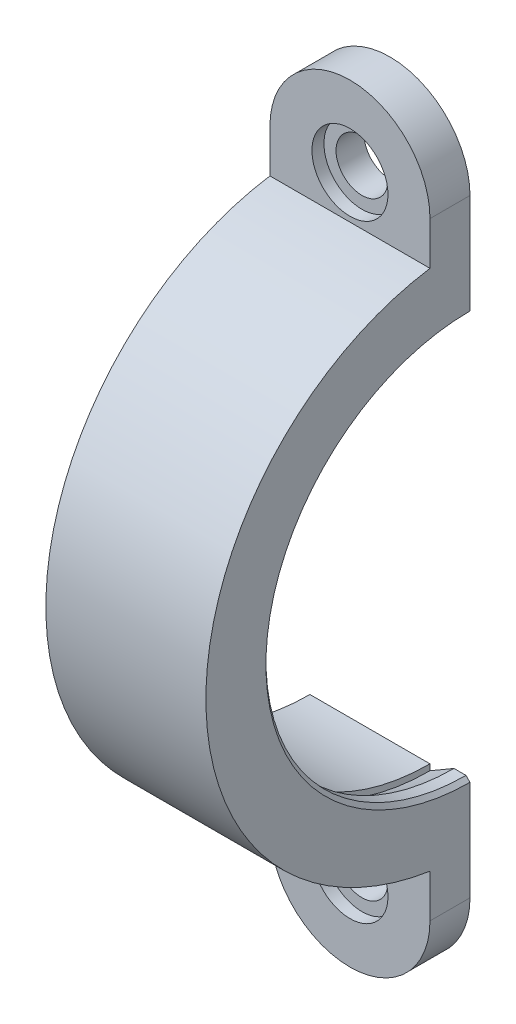
ISO-10303-21;
HEADER;
FILE_DESCRIPTION(('STEP AP214'),'2;1');
FILE_NAME('part.step','',(''),(''),'','','');
FILE_SCHEMA(('AUTOMOTIVE_DESIGN { 1 0 10303 214 1 1 1 1 }'));
ENDSEC;
DATA;
#1=APPLICATION_CONTEXT('core data for automotive mechanical design processes');
#2=APPLICATION_PROTOCOL_DEFINITION('international standard','automotive_design',2000,#1);
#3=PRODUCT_CONTEXT('',#1,'mechanical');
#4=PRODUCT('Part','Part','',(#3));
#5=PRODUCT_RELATED_PRODUCT_CATEGORY('part','',(#4));
#6=PRODUCT_DEFINITION_FORMATION('','',#4);
#7=PRODUCT_DEFINITION_CONTEXT('part definition',#1,'design');
#8=PRODUCT_DEFINITION('design','',#6,#7);
#9=PRODUCT_DEFINITION_SHAPE('','',#8);
#10=(LENGTH_UNIT() NAMED_UNIT(*) SI_UNIT(.MILLI.,.METRE.));
#11=(NAMED_UNIT(*) PLANE_ANGLE_UNIT() SI_UNIT($,.RADIAN.));
#12=(NAMED_UNIT(*) SI_UNIT($,.STERADIAN.) SOLID_ANGLE_UNIT());
#13=UNCERTAINTY_MEASURE_WITH_UNIT(LENGTH_MEASURE(1.E-05),#10,'distance_accuracy_value','');
#14=(GEOMETRIC_REPRESENTATION_CONTEXT(3) GLOBAL_UNCERTAINTY_ASSIGNED_CONTEXT((#13)) GLOBAL_UNIT_ASSIGNED_CONTEXT((#10,
#11,#12)) REPRESENTATION_CONTEXT('',''));
#15=CARTESIAN_POINT('',(0.,0.,0.));
#16=DIRECTION('',(0.,0.,1.));
#17=DIRECTION('',(1.,0.,0.));
#18=AXIS2_PLACEMENT_3D('',#15,#16,#17);
#19=CARTESIAN_POINT('',(10.,38.,33.));
#20=DIRECTION('',(0.,0.,-1.));
#21=DIRECTION('',(-1.,0.,0.));
#22=AXIS2_PLACEMENT_3D('',#19,#20,#21);
#23=CYLINDRICAL_SURFACE('',#22,3.2385);
#24=CARTESIAN_POINT('',(10.,38.,0.));
#25=DIRECTION('',(0.,0.,-1.));
#26=DIRECTION('',(-1.,0.,0.));
#27=AXIS2_PLACEMENT_3D('',#24,#25,#26);
#28=CIRCLE('',#27,3.2385);
#29=CARTESIAN_POINT('',(6.7615,38.,0.));
#30=VERTEX_POINT('',#29);
#31=EDGE_CURVE('E153',#30,#30,#28,.T.);
#32=ORIENTED_EDGE('',*,*,#31,.T.);
#33=EDGE_LOOP('',(#32));
#34=FACE_BOUND('',#33,.T.);
#35=CARTESIAN_POINT('',(10.,38.,3.5));
#36=DIRECTION('',(0.,0.,1.));
#37=DIRECTION('',(1.,0.,0.));
#38=AXIS2_PLACEMENT_3D('',#35,#36,#37);
#39=CIRCLE('',#38,3.2385);
#40=CARTESIAN_POINT('',(13.2385,38.,3.5));
#41=VERTEX_POINT('',#40);
#42=EDGE_CURVE('E224',#41,#41,#39,.F.);
#43=ORIENTED_EDGE('',*,*,#42,.F.);
#44=EDGE_LOOP('',(#43));
#45=FACE_BOUND('',#44,.T.);
#46=ADVANCED_FACE('F33',(#34,#45),#23,.F.);
#47=CARTESIAN_POINT('',(10.,-38.,33.));
#48=DIRECTION('',(0.,0.,-1.));
#49=DIRECTION('',(-1.,0.,0.));
#50=AXIS2_PLACEMENT_3D('',#47,#48,#49);
#51=CYLINDRICAL_SURFACE('',#50,3.2385);
#52=CARTESIAN_POINT('',(10.,-38.,0.));
#53=DIRECTION('',(0.,0.,-1.));
#54=DIRECTION('',(-1.,0.,0.));
#55=AXIS2_PLACEMENT_3D('',#52,#53,#54);
#56=CIRCLE('',#55,3.2385);
#57=CARTESIAN_POINT('',(6.7615,-38.,0.));
#58=VERTEX_POINT('',#57);
#59=EDGE_CURVE('E222',#58,#58,#56,.T.);
#60=ORIENTED_EDGE('',*,*,#59,.T.);
#61=EDGE_LOOP('',(#60));
#62=FACE_BOUND('',#61,.T.);
#63=CARTESIAN_POINT('',(10.,-38.,3.5));
#64=DIRECTION('',(0.,0.,1.));
#65=DIRECTION('',(1.,0.,0.));
#66=AXIS2_PLACEMENT_3D('',#63,#64,#65);
#67=CIRCLE('',#66,3.2385);
#68=CARTESIAN_POINT('',(13.2385,-38.,3.5));
#69=VERTEX_POINT('',#68);
#70=EDGE_CURVE('E219',#69,#69,#67,.F.);
#71=ORIENTED_EDGE('',*,*,#70,.F.);
#72=EDGE_LOOP('',(#71));
#73=FACE_BOUND('',#72,.T.);
#74=ADVANCED_FACE('F262',(#62,#73),#51,.F.);
#75=CARTESIAN_POINT('',(0.,0.,0.));
#76=DIRECTION('',(-1.,0.,0.));
#77=DIRECTION('',(0.,0.,1.));
#78=AXIS2_PLACEMENT_3D('',#75,#76,#77);
#79=CYLINDRICAL_SURFACE('',#78,33.);
#80=DIRECTION('',(-1.,0.,0.));
#81=VECTOR('',#80,1.);
#82=CARTESIAN_POINT('',(0.,-32.6190128606002,4.99999999999977));
#83=LINE('',#82,#81);
#84=CARTESIAN_POINT('',(20.,-32.6190128606002,4.99999999999977));
#85=VERTEX_POINT('',#84);
#86=CARTESIAN_POINT('',(0.,-32.6190128606002,4.99999999999977));
#87=VERTEX_POINT('',#86);
#88=EDGE_CURVE('E154',#85,#87,#83,.T.);
#89=ORIENTED_EDGE('',*,*,#88,.F.);
#90=CARTESIAN_POINT('',(20.,0.,0.));
#91=DIRECTION('',(-1.,0.,0.));
#92=DIRECTION('',(0.,0.,1.));
#93=AXIS2_PLACEMENT_3D('',#90,#91,#92);
#94=CIRCLE('',#93,33.);
#95=CARTESIAN_POINT('',(20.,32.6190128606002,5.));
#96=VERTEX_POINT('',#95);
#97=EDGE_CURVE('E130',#85,#96,#94,.T.);
#98=ORIENTED_EDGE('',*,*,#97,.T.);
#99=DIRECTION('',(-1.,0.,0.));
#100=VECTOR('',#99,1.);
#101=CARTESIAN_POINT('',(0.,32.6190128606002,5.));
#102=LINE('',#101,#100);
#103=CARTESIAN_POINT('',(0.,32.6190128606002,5.));
#104=VERTEX_POINT('',#103);
#105=EDGE_CURVE('E171',#96,#104,#102,.T.);
#106=ORIENTED_EDGE('',*,*,#105,.T.);
#107=CARTESIAN_POINT('',(0.,0.,0.));
#108=DIRECTION('',(-1.,0.,0.));
#109=DIRECTION('',(0.,0.,1.));
#110=AXIS2_PLACEMENT_3D('',#107,#108,#109);
#111=CIRCLE('',#110,33.);
#112=EDGE_CURVE('E211',#87,#104,#111,.T.);
#113=ORIENTED_EDGE('',*,*,#112,.F.);
#114=EDGE_LOOP('',(#89,#98,#106,#113));
#115=FACE_BOUND('',#114,.T.);
#116=ADVANCED_FACE('F247',(#115),#79,.T.);
#117=CARTESIAN_POINT('',(15.,45.946156924622,3.20840298987752E-13));
#118=DIRECTION('',(-1.,0.,0.));
#119=DIRECTION('',(0.,0.,1.));
#120=AXIS2_PLACEMENT_3D('',#117,#118,#119);
#121=PLANE('',#120);
#122=CARTESIAN_POINT('',(15.,0.,0.));
#123=DIRECTION('',(-1.,0.,0.));
#124=DIRECTION('',(0.,0.,1.));
#125=AXIS2_PLACEMENT_3D('',#122,#123,#124);
#126=CIRCLE('',#125,26.75);
#127=CARTESIAN_POINT('',(15.,-26.75,-1.86794251628108E-13));
#128=VERTEX_POINT('',#127);
#129=CARTESIAN_POINT('',(15.,26.75,0.));
#130=VERTEX_POINT('',#129);
#131=EDGE_CURVE('E216',#128,#130,#126,.T.);
#132=ORIENTED_EDGE('',*,*,#131,.F.);
#133=DIRECTION('',(0.,-1.,0.));
#134=VECTOR('',#133,1.);
#135=CARTESIAN_POINT('',(15.,45.946156924622,3.20840298987752E-13));
#136=LINE('',#135,#134);
#137=CARTESIAN_POINT('',(15.,-26.,-1.81557029619843E-13));
#138=VERTEX_POINT('',#137);
#139=EDGE_CURVE('E191',#138,#128,#136,.T.);
#140=ORIENTED_EDGE('',*,*,#139,.F.);
#141=CARTESIAN_POINT('',(15.,0.,0.));
#142=DIRECTION('',(-1.,0.,0.));
#143=DIRECTION('',(0.,0.,1.));
#144=AXIS2_PLACEMENT_3D('',#141,#142,#143);
#145=CIRCLE('',#144,26.);
#146=CARTESIAN_POINT('',(15.,26.,0.));
#147=VERTEX_POINT('',#146);
#148=EDGE_CURVE('E206',#138,#147,#145,.T.);
#149=ORIENTED_EDGE('',*,*,#148,.T.);
#150=DIRECTION('',(0.,1.,0.));
#151=VECTOR('',#150,1.);
#152=CARTESIAN_POINT('',(15.,-45.946156924622,0.));
#153=LINE('',#152,#151);
#154=EDGE_CURVE('E176',#147,#130,#153,.T.);
#155=ORIENTED_EDGE('',*,*,#154,.T.);
#156=EDGE_LOOP('',(#132,#140,#149,#155));
#157=FACE_BOUND('',#156,.T.);
#158=ADVANCED_FACE('F292',(#157),#121,.F.);
#159=CARTESIAN_POINT('',(15.,0.,0.));
#160=DIRECTION('',(-1.,0.,0.));
#161=DIRECTION('',(0.,0.,1.));
#162=AXIS2_PLACEMENT_3D('',#159,#160,#161);
#163=CONICAL_SURFACE('',#162,26.75,0.528074448426364);
#164=CARTESIAN_POINT('',(18.,0.,0.));
#165=DIRECTION('',(-1.,0.,0.));
#166=DIRECTION('',(0.,0.,1.));
#167=AXIS2_PLACEMENT_3D('',#164,#165,#166);
#168=CIRCLE('',#167,25.);
#169=CARTESIAN_POINT('',(18.,-25.,-1.74574066942157E-13));
#170=VERTEX_POINT('',#169);
#171=CARTESIAN_POINT('',(18.,25.,0.));
#172=VERTEX_POINT('',#171);
#173=EDGE_CURVE('E214',#170,#172,#168,.T.);
#174=ORIENTED_EDGE('',*,*,#173,.F.);
#175=DIRECTION('',(0.863778900898433,0.503871025524087,0.));
#176=VECTOR('',#175,1.);
#177=CARTESIAN_POINT('',(51.0635481913489,-5.71293022171306,0.));
#178=LINE('',#177,#176);
#179=EDGE_CURVE('E194',#128,#170,#178,.T.);
#180=ORIENTED_EDGE('',*,*,#179,.F.);
#181=ORIENTED_EDGE('',*,*,#131,.T.);
#182=DIRECTION('',(0.863778900898433,-0.503871025524087,0.));
#183=VECTOR('',#182,1.);
#184=CARTESIAN_POINT('',(51.0635481913489,5.71293022171306,0.));
#185=LINE('',#184,#183);
#186=EDGE_CURVE('E179',#130,#172,#185,.T.);
#187=ORIENTED_EDGE('',*,*,#186,.T.);
#188=EDGE_LOOP('',(#174,#180,#181,#187));
#189=FACE_BOUND('',#188,.T.);
#190=ADVANCED_FACE('F295',(#189),#163,.F.);
#191=CARTESIAN_POINT('',(0.,0.,0.));
#192=DIRECTION('',(-1.,0.,0.));
#193=DIRECTION('',(0.,0.,1.));
#194=AXIS2_PLACEMENT_3D('',#191,#192,#193);
#195=CYLINDRICAL_SURFACE('',#194,25.);
#196=DIRECTION('',(1.,0.,0.));
#197=VECTOR('',#196,1.);
#198=CARTESIAN_POINT('',(20.9290806893201,25.,0.));
#199=LINE('',#198,#197);
#200=CARTESIAN_POINT('',(19.5,25.,0.));
#201=VERTEX_POINT('',#200);
#202=EDGE_CURVE('E182',#172,#201,#199,.T.);
#203=ORIENTED_EDGE('',*,*,#202,.T.);
#204=CARTESIAN_POINT('',(19.5,0.,0.));
#205=DIRECTION('',(1.,0.,0.));
#206=DIRECTION('',(0.,0.,-1.));
#207=AXIS2_PLACEMENT_3D('',#204,#205,#206);
#208=CIRCLE('',#207,25.);
#209=CARTESIAN_POINT('',(19.5,-25.,-1.74574066942157E-13));
#210=VERTEX_POINT('',#209);
#211=EDGE_CURVE('E41',#201,#210,#208,.T.);
#212=ORIENTED_EDGE('',*,*,#211,.T.);
#213=DIRECTION('',(1.,0.,0.));
#214=VECTOR('',#213,1.);
#215=CARTESIAN_POINT('',(20.9290806893201,-25.,-1.74574066942157E-13));
#216=LINE('',#215,#214);
#217=EDGE_CURVE('E197',#170,#210,#216,.T.);
#218=ORIENTED_EDGE('',*,*,#217,.F.);
#219=ORIENTED_EDGE('',*,*,#173,.T.);
#220=EDGE_LOOP('',(#203,#212,#218,#219));
#221=FACE_BOUND('',#220,.T.);
#222=ADVANCED_FACE('F306',(#221),#195,.F.);
#223=CARTESIAN_POINT('',(20.,45.946156924622,3.20840298987752E-13));
#224=DIRECTION('',(1.,0.,0.));
#225=DIRECTION('',(0.,0.,-1.));
#226=AXIS2_PLACEMENT_3D('',#223,#224,#225);
#227=PLANE('',#226);
#228=DIRECTION('',(0.,1.,0.));
#229=VECTOR('',#228,1.);
#230=CARTESIAN_POINT('',(20.,45.946156924622,3.20840298987752E-13));
#231=LINE('',#230,#229);
#232=CARTESIAN_POINT('',(20.,-38.,-2.65352581752078E-13));
#233=VERTEX_POINT('',#232);
#234=CARTESIAN_POINT('',(20.,-25.5,-1.78065548281E-13));
#235=VERTEX_POINT('',#234);
#236=EDGE_CURVE('E199',#233,#235,#231,.T.);
#237=ORIENTED_EDGE('',*,*,#236,.T.);
#238=CARTESIAN_POINT('',(20.,0.,0.));
#239=DIRECTION('',(1.,0.,0.));
#240=DIRECTION('',(0.,0.,-1.));
#241=AXIS2_PLACEMENT_3D('',#238,#239,#240);
#242=CIRCLE('',#241,25.5);
#243=CARTESIAN_POINT('',(20.,25.5,0.));
#244=VERTEX_POINT('',#243);
#245=EDGE_CURVE('E218',#235,#244,#242,.F.);
#246=ORIENTED_EDGE('',*,*,#245,.T.);
#247=DIRECTION('',(0.,-1.,0.));
#248=VECTOR('',#247,1.);
#249=CARTESIAN_POINT('',(20.,-45.946156924622,0.));
#250=LINE('',#249,#248);
#251=CARTESIAN_POINT('',(20.,38.,0.));
#252=VERTEX_POINT('',#251);
#253=EDGE_CURVE('E184',#252,#244,#250,.T.);
#254=ORIENTED_EDGE('',*,*,#253,.F.);
#255=DIRECTION('',(0.,0.,-1.));
#256=VECTOR('',#255,1.);
#257=CARTESIAN_POINT('',(20.,38.,5.));
#258=LINE('',#257,#256);
#259=CARTESIAN_POINT('',(20.,38.,5.));
#260=VERTEX_POINT('',#259);
#261=EDGE_CURVE('E168',#260,#252,#258,.T.);
#262=ORIENTED_EDGE('',*,*,#261,.F.);
#263=DIRECTION('',(0.,-1.,0.));
#264=VECTOR('',#263,1.);
#265=CARTESIAN_POINT('',(20.,29.,5.));
#266=LINE('',#265,#264);
#267=EDGE_CURVE('E158',#260,#96,#266,.T.);
#268=ORIENTED_EDGE('',*,*,#267,.T.);
#269=ORIENTED_EDGE('',*,*,#97,.F.);
#270=DIRECTION('',(0.,-1.,0.));
#271=VECTOR('',#270,1.);
#272=CARTESIAN_POINT('',(20.,-29.,4.9999999999998));
#273=LINE('',#272,#271);
#274=CARTESIAN_POINT('',(20.,-38.,4.99999999999973));
#275=VERTEX_POINT('',#274);
#276=EDGE_CURVE('E123',#85,#275,#273,.T.);
#277=ORIENTED_EDGE('',*,*,#276,.T.);
#278=DIRECTION('',(0.,0.,-1.));
#279=VECTOR('',#278,1.);
#280=CARTESIAN_POINT('',(20.,-38.,4.99999999999973));
#281=LINE('',#280,#279);
#282=EDGE_CURVE('E127',#275,#233,#281,.T.);
#283=ORIENTED_EDGE('',*,*,#282,.T.);
#284=EDGE_LOOP('',(#237,#246,#254,#262,#268,#269,#277,#283));
#285=FACE_BOUND('',#284,.T.);
#286=ADVANCED_FACE('F126',(#285),#227,.T.);
#287=CARTESIAN_POINT('',(0.,45.946156924622,3.20840298987752E-13));
#288=DIRECTION('',(1.,0.,0.));
#289=DIRECTION('',(0.,0.,-1.));
#290=AXIS2_PLACEMENT_3D('',#287,#288,#289);
#291=PLANE('',#290);
#292=CARTESIAN_POINT('',(0.,0.,0.));
#293=DIRECTION('',(-1.,0.,0.));
#294=DIRECTION('',(0.,0.,1.));
#295=AXIS2_PLACEMENT_3D('',#292,#293,#294);
#296=CIRCLE('',#295,26.);
#297=CARTESIAN_POINT('',(0.,-26.,-1.81557029619843E-13));
#298=VERTEX_POINT('',#297);
#299=CARTESIAN_POINT('',(0.,26.,0.));
#300=VERTEX_POINT('',#299);
#301=EDGE_CURVE('E208',#298,#300,#296,.T.);
#302=ORIENTED_EDGE('',*,*,#301,.F.);
#303=DIRECTION('',(0.,1.,0.));
#304=VECTOR('',#303,1.);
#305=CARTESIAN_POINT('',(0.,45.946156924622,3.20840298987752E-13));
#306=LINE('',#305,#304);
#307=CARTESIAN_POINT('',(0.,-38.,-2.65352581752078E-13));
#308=VERTEX_POINT('',#307);
#309=EDGE_CURVE('E201',#308,#298,#306,.T.);
#310=ORIENTED_EDGE('',*,*,#309,.F.);
#311=DIRECTION('',(0.,0.,-1.));
#312=VECTOR('',#311,1.);
#313=CARTESIAN_POINT('',(0.,-38.,4.99999999999973));
#314=LINE('',#313,#312);
#315=CARTESIAN_POINT('',(0.,-38.,4.99999999999973));
#316=VERTEX_POINT('',#315);
#317=EDGE_CURVE('E142',#316,#308,#314,.T.);
#318=ORIENTED_EDGE('',*,*,#317,.F.);
#319=DIRECTION('',(0.,1.,0.));
#320=VECTOR('',#319,1.);
#321=CARTESIAN_POINT('',(0.,-29.,4.9999999999998));
#322=LINE('',#321,#320);
#323=EDGE_CURVE('E143',#316,#87,#322,.T.);
#324=ORIENTED_EDGE('',*,*,#323,.T.);
#325=ORIENTED_EDGE('',*,*,#112,.T.);
#326=DIRECTION('',(0.,1.,0.));
#327=VECTOR('',#326,1.);
#328=CARTESIAN_POINT('',(0.,29.,5.));
#329=LINE('',#328,#327);
#330=CARTESIAN_POINT('',(0.,38.,5.));
#331=VERTEX_POINT('',#330);
#332=EDGE_CURVE('E160',#104,#331,#329,.T.);
#333=ORIENTED_EDGE('',*,*,#332,.T.);
#334=DIRECTION('',(0.,0.,-1.));
#335=VECTOR('',#334,1.);
#336=CARTESIAN_POINT('',(0.,38.,5.));
#337=LINE('',#336,#335);
#338=CARTESIAN_POINT('',(0.,38.,0.));
#339=VERTEX_POINT('',#338);
#340=EDGE_CURVE('E165',#331,#339,#337,.T.);
#341=ORIENTED_EDGE('',*,*,#340,.T.);
#342=DIRECTION('',(0.,-1.,0.));
#343=VECTOR('',#342,1.);
#344=CARTESIAN_POINT('',(0.,-45.946156924622,0.));
#345=LINE('',#344,#343);
#346=EDGE_CURVE('E186',#339,#300,#345,.T.);
#347=ORIENTED_EDGE('',*,*,#346,.T.);
#348=EDGE_LOOP('',(#302,#310,#318,#324,#325,#333,#341,#347));
#349=FACE_BOUND('',#348,.T.);
#350=ADVANCED_FACE('F250',(#349),#291,.F.);
#351=CARTESIAN_POINT('',(0.,0.,0.));
#352=DIRECTION('',(-1.,0.,0.));
#353=DIRECTION('',(0.,0.,1.));
#354=AXIS2_PLACEMENT_3D('',#351,#352,#353);
#355=CYLINDRICAL_SURFACE('',#354,26.);
#356=DIRECTION('',(1.,0.,0.));
#357=VECTOR('',#356,1.);
#358=CARTESIAN_POINT('',(20.9290806893201,-26.,-1.81557029619843E-13));
#359=LINE('',#358,#357);
#360=EDGE_CURVE('E203',#298,#138,#359,.T.);
#361=ORIENTED_EDGE('',*,*,#360,.F.);
#362=ORIENTED_EDGE('',*,*,#301,.T.);
#363=DIRECTION('',(1.,0.,0.));
#364=VECTOR('',#363,1.);
#365=CARTESIAN_POINT('',(20.9290806893201,26.,0.));
#366=LINE('',#365,#364);
#367=EDGE_CURVE('E188',#300,#147,#366,.T.);
#368=ORIENTED_EDGE('',*,*,#367,.T.);
#369=ORIENTED_EDGE('',*,*,#148,.F.);
#370=EDGE_LOOP('',(#361,#362,#368,#369));
#371=FACE_BOUND('',#370,.T.);
#372=ADVANCED_FACE('F288',(#371),#355,.F.);
#373=CARTESIAN_POINT('',(20.9290806893201,45.946156924622,3.20840298987752E-13));
#374=DIRECTION('',(0.,0.,-1.));
#375=DIRECTION('',(1.,0.,0.));
#376=AXIS2_PLACEMENT_3D('',#373,#374,#375);
#377=PLANE('',#376);
#378=ORIENTED_EDGE('',*,*,#59,.F.);
#379=EDGE_LOOP('',(#378));
#380=FACE_BOUND('',#379,.T.);
#381=ORIENTED_EDGE('',*,*,#217,.T.);
#382=DIRECTION('',(-0.70710678118655,0.707106781186545,0.));
#383=VECTOR('',#382,1.);
#384=CARTESIAN_POINT('',(-5.50000000000016,0.,0.));
#385=LINE('',#384,#383);
#386=EDGE_CURVE('E11',#210,#235,#385,.F.);
#387=ORIENTED_EDGE('',*,*,#386,.T.);
#388=ORIENTED_EDGE('',*,*,#236,.F.);
#389=CARTESIAN_POINT('',(10.,-38.,-2.65352581752078E-13));
#390=DIRECTION('',(0.,0.,-1.));
#391=DIRECTION('',(0.,-1.,0.));
#392=AXIS2_PLACEMENT_3D('',#389,#390,#391);
#393=CIRCLE('',#392,10.);
#394=EDGE_CURVE('E135',#233,#308,#393,.T.);
#395=ORIENTED_EDGE('',*,*,#394,.T.);
#396=ORIENTED_EDGE('',*,*,#309,.T.);
#397=ORIENTED_EDGE('',*,*,#360,.T.);
#398=ORIENTED_EDGE('',*,*,#139,.T.);
#399=ORIENTED_EDGE('',*,*,#179,.T.);
#400=EDGE_LOOP('',(#381,#387,#388,#395,#396,#397,#398,#399));
#401=FACE_BOUND('',#400,.T.);
#402=ADVANCED_FACE('F252',(#380,#401),#377,.T.);
#403=CARTESIAN_POINT('',(20.9290806893201,-45.946156924622,0.));
#404=DIRECTION('',(0.,0.,1.));
#405=DIRECTION('',(1.,0.,0.));
#406=AXIS2_PLACEMENT_3D('',#403,#404,#405);
#407=PLANE('',#406);
#408=ORIENTED_EDGE('',*,*,#31,.F.);
#409=EDGE_LOOP('',(#408));
#410=FACE_BOUND('',#409,.T.);
#411=ORIENTED_EDGE('',*,*,#253,.T.);
#412=DIRECTION('',(-0.70710678118655,-0.707106781186545,0.));
#413=VECTOR('',#412,1.);
#414=CARTESIAN_POINT('',(-5.50000000000016,0.,0.));
#415=LINE('',#414,#413);
#416=EDGE_CURVE('E55',#244,#201,#415,.T.);
#417=ORIENTED_EDGE('',*,*,#416,.T.);
#418=ORIENTED_EDGE('',*,*,#202,.F.);
#419=ORIENTED_EDGE('',*,*,#186,.F.);
#420=ORIENTED_EDGE('',*,*,#154,.F.);
#421=ORIENTED_EDGE('',*,*,#367,.F.);
#422=ORIENTED_EDGE('',*,*,#346,.F.);
#423=CARTESIAN_POINT('',(10.,38.,0.));
#424=DIRECTION('',(0.,0.,-1.));
#425=DIRECTION('',(-1.,0.,0.));
#426=AXIS2_PLACEMENT_3D('',#423,#424,#425);
#427=CIRCLE('',#426,10.);
#428=EDGE_CURVE('E157',#339,#252,#427,.T.);
#429=ORIENTED_EDGE('',*,*,#428,.T.);
#430=EDGE_LOOP('',(#411,#417,#418,#419,#420,#421,#422,#429));
#431=FACE_BOUND('',#430,.T.);
#432=ADVANCED_FACE('F234',(#410,#431),#407,.F.);
#433=CARTESIAN_POINT('',(10.,38.,5.));
#434=DIRECTION('',(0.,0.,-1.));
#435=DIRECTION('',(-1.,0.,0.));
#436=AXIS2_PLACEMENT_3D('',#433,#434,#435);
#437=CYLINDRICAL_SURFACE('',#436,10.);
#438=ORIENTED_EDGE('',*,*,#428,.F.);
#439=ORIENTED_EDGE('',*,*,#340,.F.);
#440=CARTESIAN_POINT('',(10.,38.,5.));
#441=DIRECTION('',(0.,0.,-1.));
#442=DIRECTION('',(-1.,0.,0.));
#443=AXIS2_PLACEMENT_3D('',#440,#441,#442);
#444=CIRCLE('',#443,10.);
#445=EDGE_CURVE('E162',#331,#260,#444,.T.);
#446=ORIENTED_EDGE('',*,*,#445,.T.);
#447=ORIENTED_EDGE('',*,*,#261,.T.);
#448=EDGE_LOOP('',(#438,#439,#446,#447));
#449=FACE_BOUND('',#448,.T.);
#450=ADVANCED_FACE('F239',(#449),#437,.T.);
#451=CARTESIAN_POINT('',(10.,38.,5.));
#452=DIRECTION('',(0.,0.,-1.));
#453=DIRECTION('',(-1.,0.,0.));
#454=AXIS2_PLACEMENT_3D('',#451,#452,#453);
#455=PLANE('',#454);
#456=CARTESIAN_POINT('',(10.,38.,5.));
#457=DIRECTION('',(0.,0.,1.));
#458=DIRECTION('',(1.,0.,0.));
#459=AXIS2_PLACEMENT_3D('',#456,#457,#458);
#460=CIRCLE('',#459,4.75000000000001);
#461=CARTESIAN_POINT('',(14.75,38.,5.));
#462=VERTEX_POINT('',#461);
#463=EDGE_CURVE('E462',#462,#462,#460,.T.);
#464=ORIENTED_EDGE('',*,*,#463,.F.);
#465=EDGE_LOOP('',(#464));
#466=FACE_BOUND('',#465,.T.);
#467=ORIENTED_EDGE('',*,*,#105,.F.);
#468=ORIENTED_EDGE('',*,*,#267,.F.);
#469=ORIENTED_EDGE('',*,*,#445,.F.);
#470=ORIENTED_EDGE('',*,*,#332,.F.);
#471=EDGE_LOOP('',(#467,#468,#469,#470));
#472=FACE_BOUND('',#471,.T.);
#473=ADVANCED_FACE('F244',(#466,#472),#455,.F.);
#474=CARTESIAN_POINT('',(10.,-38.,4.99999999999973));
#475=DIRECTION('',(0.,0.,-1.));
#476=DIRECTION('',(0.,1.,0.));
#477=AXIS2_PLACEMENT_3D('',#474,#475,#476);
#478=CYLINDRICAL_SURFACE('',#477,10.);
#479=ORIENTED_EDGE('',*,*,#394,.F.);
#480=ORIENTED_EDGE('',*,*,#282,.F.);
#481=CARTESIAN_POINT('',(10.,-38.,4.99999999999973));
#482=DIRECTION('',(0.,0.,-1.));
#483=DIRECTION('',(0.,-1.,0.));
#484=AXIS2_PLACEMENT_3D('',#481,#482,#483);
#485=CIRCLE('',#484,10.);
#486=EDGE_CURVE('E134',#275,#316,#485,.T.);
#487=ORIENTED_EDGE('',*,*,#486,.T.);
#488=ORIENTED_EDGE('',*,*,#317,.T.);
#489=EDGE_LOOP('',(#479,#480,#487,#488));
#490=FACE_BOUND('',#489,.T.);
#491=ADVANCED_FACE('F139',(#490),#478,.T.);
#492=CARTESIAN_POINT('',(10.,-38.,4.99999999999973));
#493=DIRECTION('',(0.,0.,1.));
#494=DIRECTION('',(0.,-1.,0.));
#495=AXIS2_PLACEMENT_3D('',#492,#493,#494);
#496=PLANE('',#495);
#497=CARTESIAN_POINT('',(10.,-38.,5.));
#498=DIRECTION('',(0.,0.,1.));
#499=DIRECTION('',(1.,0.,0.));
#500=AXIS2_PLACEMENT_3D('',#497,#498,#499);
#501=CIRCLE('',#500,4.75000000000001);
#502=CARTESIAN_POINT('',(14.75,-38.,5.));
#503=VERTEX_POINT('',#502);
#504=EDGE_CURVE('E227',#503,#503,#501,.T.);
#505=ORIENTED_EDGE('',*,*,#504,.F.);
#506=EDGE_LOOP('',(#505));
#507=FACE_BOUND('',#506,.T.);
#508=ORIENTED_EDGE('',*,*,#276,.F.);
#509=ORIENTED_EDGE('',*,*,#88,.T.);
#510=ORIENTED_EDGE('',*,*,#323,.F.);
#511=ORIENTED_EDGE('',*,*,#486,.F.);
#512=EDGE_LOOP('',(#508,#509,#510,#511));
#513=FACE_BOUND('',#512,.T.);
#514=ADVANCED_FACE('F146',(#507,#513),#496,.T.);
#515=CARTESIAN_POINT('',(10.,-38.,3.5));
#516=DIRECTION('',(0.,0.,1.));
#517=DIRECTION('',(1.,0.,0.));
#518=AXIS2_PLACEMENT_3D('',#515,#516,#517);
#519=PLANE('',#518);
#520=CARTESIAN_POINT('',(10.,-38.,3.5));
#521=DIRECTION('',(0.,0.,1.));
#522=DIRECTION('',(1.,0.,0.));
#523=AXIS2_PLACEMENT_3D('',#520,#521,#522);
#524=CIRCLE('',#523,4.75000000000001);
#525=CARTESIAN_POINT('',(14.75,-38.,3.5));
#526=VERTEX_POINT('',#525);
#527=EDGE_CURVE('E223',#526,#526,#524,.T.);
#528=ORIENTED_EDGE('',*,*,#527,.T.);
#529=EDGE_LOOP('',(#528));
#530=FACE_BOUND('',#529,.T.);
#531=ORIENTED_EDGE('',*,*,#70,.T.);
#532=EDGE_LOOP('',(#531));
#533=FACE_BOUND('',#532,.T.);
#534=ADVANCED_FACE('F276',(#530,#533),#519,.T.);
#535=CARTESIAN_POINT('',(10.,-38.,3.5));
#536=DIRECTION('',(0.,0.,1.));
#537=DIRECTION('',(1.,0.,0.));
#538=AXIS2_PLACEMENT_3D('',#535,#536,#537);
#539=CYLINDRICAL_SURFACE('',#538,4.75000000000001);
#540=ORIENTED_EDGE('',*,*,#527,.F.);
#541=EDGE_LOOP('',(#540));
#542=FACE_BOUND('',#541,.T.);
#543=ORIENTED_EDGE('',*,*,#504,.T.);
#544=EDGE_LOOP('',(#543));
#545=FACE_BOUND('',#544,.T.);
#546=ADVANCED_FACE('F368',(#542,#545),#539,.F.);
#547=CARTESIAN_POINT('',(10.,38.,3.5));
#548=DIRECTION('',(0.,0.,1.));
#549=DIRECTION('',(1.,0.,0.));
#550=AXIS2_PLACEMENT_3D('',#547,#548,#549);
#551=PLANE('',#550);
#552=CARTESIAN_POINT('',(10.,38.,3.5));
#553=DIRECTION('',(0.,0.,1.));
#554=DIRECTION('',(1.,0.,0.));
#555=AXIS2_PLACEMENT_3D('',#552,#553,#554);
#556=CIRCLE('',#555,4.75000000000001);
#557=CARTESIAN_POINT('',(14.75,38.,3.5));
#558=VERTEX_POINT('',#557);
#559=EDGE_CURVE('E228',#558,#558,#556,.T.);
#560=ORIENTED_EDGE('',*,*,#559,.T.);
#561=EDGE_LOOP('',(#560));
#562=FACE_BOUND('',#561,.T.);
#563=ORIENTED_EDGE('',*,*,#42,.T.);
#564=EDGE_LOOP('',(#563));
#565=FACE_BOUND('',#564,.T.);
#566=ADVANCED_FACE('F258',(#562,#565),#551,.T.);
#567=CARTESIAN_POINT('',(10.,38.,3.5));
#568=DIRECTION('',(0.,0.,1.));
#569=DIRECTION('',(1.,0.,0.));
#570=AXIS2_PLACEMENT_3D('',#567,#568,#569);
#571=CYLINDRICAL_SURFACE('',#570,4.75000000000001);
#572=ORIENTED_EDGE('',*,*,#559,.F.);
#573=EDGE_LOOP('',(#572));
#574=FACE_BOUND('',#573,.T.);
#575=ORIENTED_EDGE('',*,*,#463,.T.);
#576=EDGE_LOOP('',(#575));
#577=FACE_BOUND('',#576,.T.);
#578=ADVANCED_FACE('F254',(#574,#577),#571,.F.);
#579=CARTESIAN_POINT('',(20.,0.,0.));
#580=DIRECTION('',(1.,0.,0.));
#581=DIRECTION('',(0.,0.,-1.));
#582=AXIS2_PLACEMENT_3D('',#579,#580,#581);
#583=CONICAL_SURFACE('',#582,25.5,0.785398163397445);
#584=ORIENTED_EDGE('',*,*,#386,.F.);
#585=ORIENTED_EDGE('',*,*,#211,.F.);
#586=ORIENTED_EDGE('',*,*,#416,.F.);
#587=ORIENTED_EDGE('',*,*,#245,.F.);
#588=EDGE_LOOP('',(#584,#585,#586,#587));
#589=FACE_BOUND('',#588,.T.);
#590=ADVANCED_FACE('F35',(#589),#583,.F.);
#591=CLOSED_SHELL('',(#46,#74,#116,#158,#190,#222,#286,#350,#372,#402,#432,#450,#473,#491,#514,
#534,#546,#566,#578,#590));
#592=MANIFOLD_SOLID_BREP('B2',#591);
#593=ADVANCED_BREP_SHAPE_REPRESENTATION('',(#18,#592),#14);
#594=SHAPE_DEFINITION_REPRESENTATION(#9,#593);
ENDSEC;
END-ISO-10303-21;
